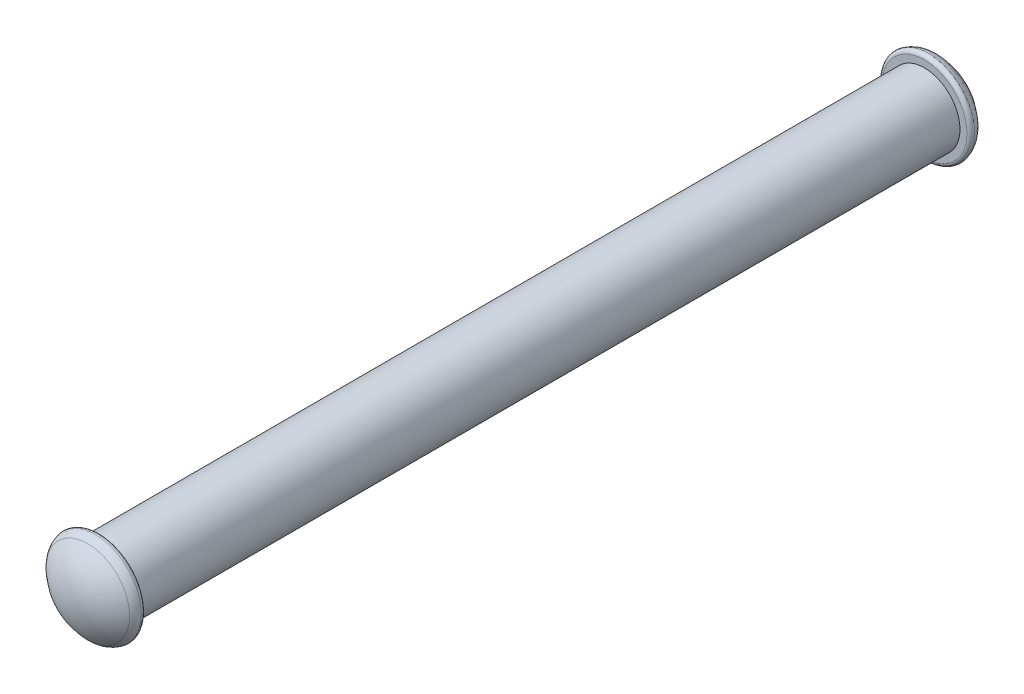
ISO-10303-21;
HEADER;
FILE_DESCRIPTION(('STEP AP214'),'2;1');
FILE_NAME('part.step','',(''),(''),'','','');
FILE_SCHEMA(('AUTOMOTIVE_DESIGN { 1 0 10303 214 1 1 1 1 }'));
ENDSEC;
DATA;
#1=APPLICATION_CONTEXT('core data for automotive mechanical design processes');
#2=APPLICATION_PROTOCOL_DEFINITION('international standard','automotive_design',2000,#1);
#3=PRODUCT_CONTEXT('',#1,'mechanical');
#4=PRODUCT('Part','Part','',(#3));
#5=PRODUCT_RELATED_PRODUCT_CATEGORY('part','',(#4));
#6=PRODUCT_DEFINITION_FORMATION('','',#4);
#7=PRODUCT_DEFINITION_CONTEXT('part definition',#1,'design');
#8=PRODUCT_DEFINITION('design','',#6,#7);
#9=PRODUCT_DEFINITION_SHAPE('','',#8);
#10=(LENGTH_UNIT() NAMED_UNIT(*) SI_UNIT(.MILLI.,.METRE.));
#11=(NAMED_UNIT(*) PLANE_ANGLE_UNIT() SI_UNIT($,.RADIAN.));
#12=(NAMED_UNIT(*) SI_UNIT($,.STERADIAN.) SOLID_ANGLE_UNIT());
#13=UNCERTAINTY_MEASURE_WITH_UNIT(LENGTH_MEASURE(1.E-05),#10,'distance_accuracy_value','');
#14=(GEOMETRIC_REPRESENTATION_CONTEXT(3) GLOBAL_UNCERTAINTY_ASSIGNED_CONTEXT((#13)) GLOBAL_UNIT_ASSIGNED_CONTEXT((#10,
#11,#12)) REPRESENTATION_CONTEXT('',''));
#15=CARTESIAN_POINT('',(0.,0.,0.));
#16=DIRECTION('',(0.,0.,1.));
#17=DIRECTION('',(1.,0.,0.));
#18=AXIS2_PLACEMENT_3D('',#15,#16,#17);
#19=CARTESIAN_POINT('',(0.,0.,5.8));
#20=DIRECTION('',(0.,0.,-1.));
#21=DIRECTION('',(-1.,0.,0.));
#22=AXIS2_PLACEMENT_3D('',#19,#20,#21);
#23=CYLINDRICAL_SURFACE('',#22,0.5);
#24=CARTESIAN_POINT('',(0.,0.,5.8));
#25=DIRECTION('',(0.,0.,1.));
#26=DIRECTION('',(1.,0.,0.));
#27=AXIS2_PLACEMENT_3D('',#24,#25,#26);
#28=CIRCLE('',#27,0.5);
#29=CARTESIAN_POINT('',(0.5,0.,5.8));
#30=VERTEX_POINT('',#29);
#31=EDGE_CURVE('E46',#30,#30,#28,.T.);
#32=ORIENTED_EDGE('',*,*,#31,.F.);
#33=EDGE_LOOP('',(#32));
#34=FACE_BOUND('',#33,.T.);
#35=CARTESIAN_POINT('',(0.,0.,-5.8));
#36=DIRECTION('',(0.,0.,-1.));
#37=DIRECTION('',(-1.,0.,0.));
#38=AXIS2_PLACEMENT_3D('',#35,#36,#37);
#39=CIRCLE('',#38,0.5);
#40=CARTESIAN_POINT('',(-0.5,0.,-5.8));
#41=VERTEX_POINT('',#40);
#42=EDGE_CURVE('E51',#41,#41,#39,.T.);
#43=ORIENTED_EDGE('',*,*,#42,.F.);
#44=EDGE_LOOP('',(#43));
#45=FACE_BOUND('',#44,.T.);
#46=ADVANCED_FACE('F31',(#34,#45),#23,.T.);
#47=CARTESIAN_POINT('',(0.,0.,5.8));
#48=DIRECTION('',(0.,0.,1.));
#49=DIRECTION('',(1.,0.,0.));
#50=AXIS2_PLACEMENT_3D('',#47,#48,#49);
#51=PLANE('',#50);
#52=CARTESIAN_POINT('',(0.,0.,5.8));
#53=DIRECTION('',(0.,0.,1.));
#54=DIRECTION('',(1.,0.,0.));
#55=AXIS2_PLACEMENT_3D('',#52,#53,#54);
#56=CIRCLE('',#55,0.597097030157399);
#57=CARTESIAN_POINT('',(0.597097030157399,0.,5.8));
#58=VERTEX_POINT('',#57);
#59=EDGE_CURVE('E10',#58,#58,#56,.F.);
#60=ORIENTED_EDGE('',*,*,#59,.T.);
#61=EDGE_LOOP('',(#60));
#62=FACE_BOUND('',#61,.T.);
#63=ORIENTED_EDGE('',*,*,#31,.T.);
#64=EDGE_LOOP('',(#63));
#65=FACE_BOUND('',#64,.T.);
#66=ADVANCED_FACE('F76',(#62,#65),#51,.F.);
#67=CARTESIAN_POINT('',(0.,0.,5.34583333333333));
#68=DIRECTION('',(0.,0.,1.));
#69=DIRECTION('',(1.,0.,0.));
#70=AXIS2_PLACEMENT_3D('',#67,#68,#69);
#71=SPHERICAL_SURFACE('',#70,0.854166666666667);
#72=CARTESIAN_POINT('',(0.,0.,5.96579372493108));
#73=DIRECTION('',(0.,0.,-1.));
#74=DIRECTION('',(-1.,0.,0.));
#75=AXIS2_PLACEMENT_3D('',#72,#73,#74);
#76=CIRCLE('',#75,0.587579617834395);
#77=CARTESIAN_POINT('',(-0.587579617834395,0.,5.96579372493108));
#78=VERTEX_POINT('',#77);
#79=EDGE_CURVE('E42',#78,#78,#76,.F.);
#80=ORIENTED_EDGE('',*,*,#79,.T.);
#81=EDGE_LOOP('',(#80));
#82=FACE_BOUND('',#81,.T.);
#83=ADVANCED_FACE('F82',(#82),#71,.T.);
#84=CARTESIAN_POINT('',(0.,0.,5.82063226738624));
#85=DIRECTION('',(0.,0.,-1.));
#86=DIRECTION('',(-1.,0.,0.));
#87=AXIS2_PLACEMENT_3D('',#84,#85,#86);
#88=TOROIDAL_SURFACE('',#87,0.45,0.2);
#89=CARTESIAN_POINT('',(0.,0.,5.85978924420459));
#90=DIRECTION('',(0.,0.,-1.));
#91=DIRECTION('',(-1.,0.,0.));
#92=AXIS2_PLACEMENT_3D('',#89,#90,#91);
#93=CIRCLE('',#92,0.646129373543198);
#94=CARTESIAN_POINT('',(-0.646129373543198,0.,5.85978924420459));
#95=VERTEX_POINT('',#94);
#96=EDGE_CURVE('E38',#95,#95,#93,.F.);
#97=ORIENTED_EDGE('',*,*,#96,.T.);
#98=EDGE_LOOP('',(#97));
#99=FACE_BOUND('',#98,.T.);
#100=ORIENTED_EDGE('',*,*,#79,.F.);
#101=EDGE_LOOP('',(#100));
#102=FACE_BOUND('',#101,.T.);
#103=ADVANCED_FACE('F89',(#99,#102),#88,.T.);
#104=CARTESIAN_POINT('',(0.,0.,5.85));
#105=DIRECTION('',(0.,0.,1.));
#106=DIRECTION('',(1.,0.,0.));
#107=AXIS2_PLACEMENT_3D('',#104,#105,#106);
#108=TOROIDAL_SURFACE('',#107,0.597097030157399,0.05);
#109=ORIENTED_EDGE('',*,*,#59,.F.);
#110=EDGE_LOOP('',(#109));
#111=FACE_BOUND('',#110,.T.);
#112=ORIENTED_EDGE('',*,*,#96,.F.);
#113=EDGE_LOOP('',(#112));
#114=FACE_BOUND('',#113,.T.);
#115=ADVANCED_FACE('F33',(#111,#114),#108,.T.);
#116=CARTESIAN_POINT('',(0.,0.,-5.8));
#117=DIRECTION('',(0.,0.,-1.));
#118=DIRECTION('',(1.,0.,0.));
#119=AXIS2_PLACEMENT_3D('',#116,#117,#118);
#120=PLANE('',#119);
#121=CARTESIAN_POINT('',(0.,0.,-5.8));
#122=DIRECTION('',(0.,0.,1.));
#123=DIRECTION('',(1.,0.,0.));
#124=AXIS2_PLACEMENT_3D('',#121,#122,#123);
#125=CIRCLE('',#124,0.597097030157399);
#126=CARTESIAN_POINT('',(0.597097030157399,0.,-5.8));
#127=VERTEX_POINT('',#126);
#128=EDGE_CURVE('E54',#127,#127,#125,.F.);
#129=ORIENTED_EDGE('',*,*,#128,.F.);
#130=EDGE_LOOP('',(#129));
#131=FACE_BOUND('',#130,.T.);
#132=ORIENTED_EDGE('',*,*,#42,.T.);
#133=EDGE_LOOP('',(#132));
#134=FACE_BOUND('',#133,.T.);
#135=ADVANCED_FACE('F95',(#131,#134),#120,.F.);
#136=CARTESIAN_POINT('',(0.,0.,-5.85));
#137=DIRECTION('',(0.,0.,-1.));
#138=DIRECTION('',(1.,0.,0.));
#139=AXIS2_PLACEMENT_3D('',#136,#137,#138);
#140=TOROIDAL_SURFACE('',#139,0.597097030157399,0.05);
#141=ORIENTED_EDGE('',*,*,#128,.T.);
#142=EDGE_LOOP('',(#141));
#143=FACE_BOUND('',#142,.T.);
#144=CARTESIAN_POINT('',(0.,0.,-5.85978924420459));
#145=DIRECTION('',(0.,0.,-1.));
#146=DIRECTION('',(-1.,0.,0.));
#147=AXIS2_PLACEMENT_3D('',#144,#145,#146);
#148=CIRCLE('',#147,0.646129373543198);
#149=CARTESIAN_POINT('',(-0.646129373543198,0.,-5.85978924420459));
#150=VERTEX_POINT('',#149);
#151=EDGE_CURVE('E57',#150,#150,#148,.F.);
#152=ORIENTED_EDGE('',*,*,#151,.T.);
#153=EDGE_LOOP('',(#152));
#154=FACE_BOUND('',#153,.T.);
#155=ADVANCED_FACE('F72',(#143,#154),#140,.T.);
#156=CARTESIAN_POINT('',(0.,0.,-5.82063226738624));
#157=DIRECTION('',(0.,0.,1.));
#158=DIRECTION('',(-1.,0.,0.));
#159=AXIS2_PLACEMENT_3D('',#156,#157,#158);
#160=TOROIDAL_SURFACE('',#159,0.45,0.2);
#161=ORIENTED_EDGE('',*,*,#151,.F.);
#162=EDGE_LOOP('',(#161));
#163=FACE_BOUND('',#162,.T.);
#164=CARTESIAN_POINT('',(0.,0.,-5.96579372493108));
#165=DIRECTION('',(0.,0.,-1.));
#166=DIRECTION('',(-1.,0.,0.));
#167=AXIS2_PLACEMENT_3D('',#164,#165,#166);
#168=CIRCLE('',#167,0.587579617834395);
#169=CARTESIAN_POINT('',(-0.587579617834395,0.,-5.96579372493108));
#170=VERTEX_POINT('',#169);
#171=EDGE_CURVE('E60',#170,#170,#168,.F.);
#172=ORIENTED_EDGE('',*,*,#171,.T.);
#173=EDGE_LOOP('',(#172));
#174=FACE_BOUND('',#173,.T.);
#175=ADVANCED_FACE('F64',(#163,#174),#160,.T.);
#176=CARTESIAN_POINT('',(0.,0.,-5.34583333333333));
#177=DIRECTION('',(0.,0.,-1.));
#178=DIRECTION('',(1.,0.,0.));
#179=AXIS2_PLACEMENT_3D('',#176,#177,#178);
#180=SPHERICAL_SURFACE('',#179,0.854166666666667);
#181=ORIENTED_EDGE('',*,*,#171,.F.);
#182=EDGE_LOOP('',(#181));
#183=FACE_BOUND('',#182,.T.);
#184=ADVANCED_FACE('F66',(#183),#180,.T.);
#185=CLOSED_SHELL('',(#46,#66,#83,#103,#115,#135,#155,#175,#184));
#186=MANIFOLD_SOLID_BREP('B2',#185);
#187=ADVANCED_BREP_SHAPE_REPRESENTATION('',(#18,#186),#14);
#188=SHAPE_DEFINITION_REPRESENTATION(#9,#187);
ENDSEC;
END-ISO-10303-21;
